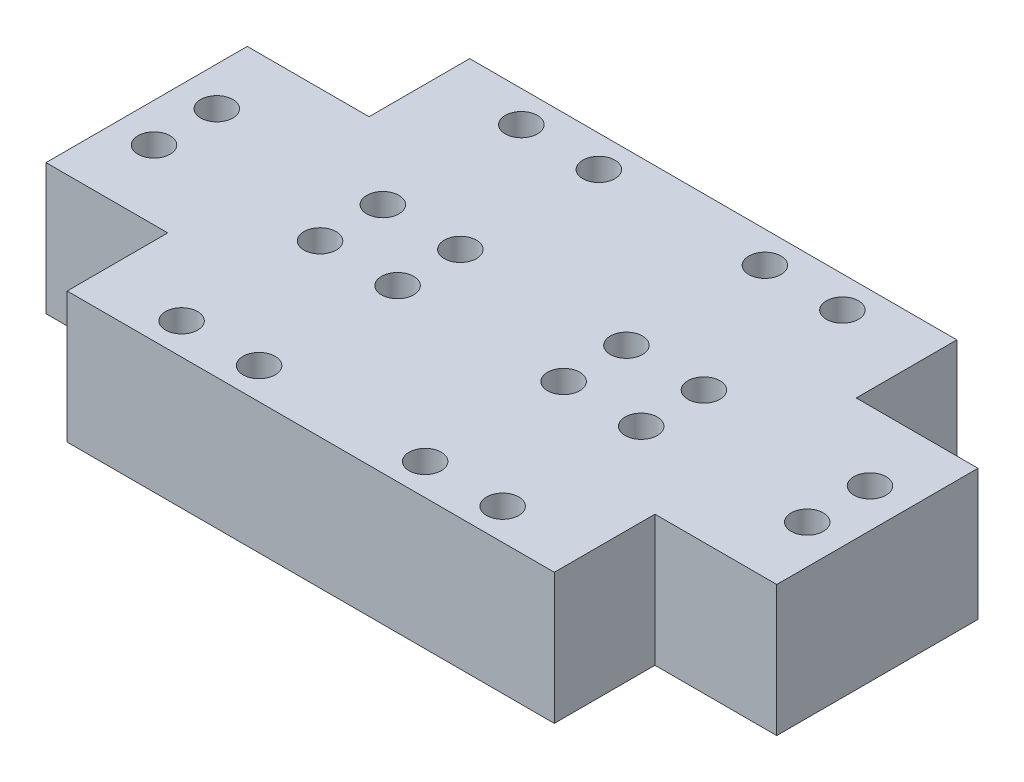
ISO-10303-21;
HEADER;
FILE_DESCRIPTION(('STEP AP214'),'2;1');
FILE_NAME('part.step','',(''),(''),'','','');
FILE_SCHEMA(('AUTOMOTIVE_DESIGN { 1 0 10303 214 1 1 1 1 }'));
ENDSEC;
DATA;
#1=APPLICATION_CONTEXT('core data for automotive mechanical design processes');
#2=APPLICATION_PROTOCOL_DEFINITION('international standard','automotive_design',2000,#1);
#3=PRODUCT_CONTEXT('',#1,'mechanical');
#4=PRODUCT('Part','Part','',(#3));
#5=PRODUCT_RELATED_PRODUCT_CATEGORY('part','',(#4));
#6=PRODUCT_DEFINITION_FORMATION('','',#4);
#7=PRODUCT_DEFINITION_CONTEXT('part definition',#1,'design');
#8=PRODUCT_DEFINITION('design','',#6,#7);
#9=PRODUCT_DEFINITION_SHAPE('','',#8);
#10=(LENGTH_UNIT() NAMED_UNIT(*) SI_UNIT(.MILLI.,.METRE.));
#11=(NAMED_UNIT(*) PLANE_ANGLE_UNIT() SI_UNIT($,.RADIAN.));
#12=(NAMED_UNIT(*) SI_UNIT($,.STERADIAN.) SOLID_ANGLE_UNIT());
#13=UNCERTAINTY_MEASURE_WITH_UNIT(LENGTH_MEASURE(1.E-05),#10,'distance_accuracy_value','');
#14=(GEOMETRIC_REPRESENTATION_CONTEXT(3) GLOBAL_UNCERTAINTY_ASSIGNED_CONTEXT((#13)) GLOBAL_UNIT_ASSIGNED_CONTEXT((#10,
#11,#12)) REPRESENTATION_CONTEXT('',''));
#15=CARTESIAN_POINT('',(0.,0.,0.));
#16=DIRECTION('',(0.,0.,1.));
#17=DIRECTION('',(1.,0.,0.));
#18=AXIS2_PLACEMENT_3D('',#15,#16,#17);
#19=CARTESIAN_POINT('',(0.,10.,0.));
#20=DIRECTION('',(0.,0.,-1.));
#21=DIRECTION('',(-1.,0.,0.));
#22=AXIS2_PLACEMENT_3D('',#19,#20,#21);
#23=PLANE('',#22);
#24=DIRECTION('',(0.,-1.,0.));
#25=VECTOR('',#24,1.);
#26=CARTESIAN_POINT('',(0.,10.,0.));
#27=LINE('',#26,#25);
#28=CARTESIAN_POINT('',(0.,10.,0.));
#29=VERTEX_POINT('',#28);
#30=CARTESIAN_POINT('',(0.,0.,0.));
#31=VERTEX_POINT('',#30);
#32=EDGE_CURVE('E53',#29,#31,#27,.T.);
#33=ORIENTED_EDGE('',*,*,#32,.F.);
#34=DIRECTION('',(1.,0.,0.));
#35=VECTOR('',#34,1.);
#36=CARTESIAN_POINT('',(0.,10.,0.));
#37=LINE('',#36,#35);
#38=CARTESIAN_POINT('',(-9.30453899683921,10.,0.));
#39=VERTEX_POINT('',#38);
#40=EDGE_CURVE('E11',#39,#29,#37,.T.);
#41=ORIENTED_EDGE('',*,*,#40,.F.);
#42=DIRECTION('',(0.,-1.,0.));
#43=VECTOR('',#42,1.);
#44=CARTESIAN_POINT('',(-9.30453899683921,10.,0.));
#45=LINE('',#44,#43);
#46=CARTESIAN_POINT('',(-9.30453899683921,0.,0.));
#47=VERTEX_POINT('',#46);
#48=EDGE_CURVE('E392',#39,#47,#45,.T.);
#49=ORIENTED_EDGE('',*,*,#48,.T.);
#50=DIRECTION('',(1.,0.,0.));
#51=VECTOR('',#50,1.);
#52=CARTESIAN_POINT('',(0.,0.,0.));
#53=LINE('',#52,#51);
#54=EDGE_CURVE('E41',#47,#31,#53,.T.);
#55=ORIENTED_EDGE('',*,*,#54,.T.);
#56=EDGE_LOOP('',(#33,#41,#49,#55));
#57=FACE_BOUND('',#56,.T.);
#58=ADVANCED_FACE('F38',(#57),#23,.F.);
#59=CARTESIAN_POINT('',(0.,10.,0.));
#60=DIRECTION('',(0.,-1.,0.));
#61=DIRECTION('',(0.,0.,-1.));
#62=AXIS2_PLACEMENT_3D('',#59,#60,#61);
#63=PLANE('',#62);
#64=DIRECTION('',(-1.,0.,0.));
#65=VECTOR('',#64,1.);
#66=CARTESIAN_POINT('',(0.,10.,7.68791394751453));
#67=LINE('',#66,#65);
#68=CARTESIAN_POINT('',(37.2181559873568,10.,7.68791394751453));
#69=VERTEX_POINT('',#68);
#70=CARTESIAN_POINT('',(0.,10.,7.68791394751453));
#71=VERTEX_POINT('',#70);
#72=EDGE_CURVE('E364',#69,#71,#67,.T.);
#73=ORIENTED_EDGE('',*,*,#72,.F.);
#74=DIRECTION('',(0.,0.,-1.));
#75=VECTOR('',#74,1.);
#76=CARTESIAN_POINT('',(37.2181559873568,10.,0.));
#77=LINE('',#76,#75);
#78=CARTESIAN_POINT('',(37.2181559873568,10.,0.));
#79=VERTEX_POINT('',#78);
#80=EDGE_CURVE('E222',#69,#79,#77,.T.);
#81=ORIENTED_EDGE('',*,*,#80,.T.);
#82=DIRECTION('',(-1.,0.,0.));
#83=VECTOR('',#82,1.);
#84=CARTESIAN_POINT('',(37.2181559873568,10.,0.));
#85=LINE('',#84,#83);
#86=CARTESIAN_POINT('',(46.5226949841961,10.,0.));
#87=VERTEX_POINT('',#86);
#88=EDGE_CURVE('E263',#87,#79,#85,.T.);
#89=ORIENTED_EDGE('',*,*,#88,.F.);
#90=DIRECTION('',(0.,0.,-1.));
#91=VECTOR('',#90,1.);
#92=CARTESIAN_POINT('',(46.5226949841961,10.,0.));
#93=LINE('',#92,#91);
#94=CARTESIAN_POINT('',(46.5226949841961,10.,-15.3758278950291));
#95=VERTEX_POINT('',#94);
#96=EDGE_CURVE('E244',#87,#95,#93,.T.);
#97=ORIENTED_EDGE('',*,*,#96,.T.);
#98=DIRECTION('',(-1.,0.,0.));
#99=VECTOR('',#98,1.);
#100=CARTESIAN_POINT('',(37.2181559873568,10.,-15.3758278950291));
#101=LINE('',#100,#99);
#102=CARTESIAN_POINT('',(37.2181559873568,10.,-15.3758278950291));
#103=VERTEX_POINT('',#102);
#104=EDGE_CURVE('E153',#95,#103,#101,.T.);
#105=ORIENTED_EDGE('',*,*,#104,.T.);
#106=DIRECTION('',(0.,0.,1.));
#107=VECTOR('',#106,1.);
#108=CARTESIAN_POINT('',(37.2181559873568,10.,-15.3758278950291));
#109=LINE('',#108,#107);
#110=CARTESIAN_POINT('',(37.2181559873568,10.,-23.0637418425436));
#111=VERTEX_POINT('',#110);
#112=EDGE_CURVE('E141',#111,#103,#109,.T.);
#113=ORIENTED_EDGE('',*,*,#112,.F.);
#114=DIRECTION('',(-1.,0.,0.));
#115=VECTOR('',#114,1.);
#116=CARTESIAN_POINT('',(0.,10.,-23.0637418425436));
#117=LINE('',#116,#115);
#118=CARTESIAN_POINT('',(0.,10.,-23.0637418425436));
#119=VERTEX_POINT('',#118);
#120=EDGE_CURVE('E124',#111,#119,#117,.T.);
#121=ORIENTED_EDGE('',*,*,#120,.T.);
#122=DIRECTION('',(0.,0.,1.));
#123=VECTOR('',#122,1.);
#124=CARTESIAN_POINT('',(0.,10.,-15.3758278950291));
#125=LINE('',#124,#123);
#126=CARTESIAN_POINT('',(0.,10.,-15.3758278950291));
#127=VERTEX_POINT('',#126);
#128=EDGE_CURVE('E136',#119,#127,#125,.T.);
#129=ORIENTED_EDGE('',*,*,#128,.T.);
#130=DIRECTION('',(1.,0.,0.));
#131=VECTOR('',#130,1.);
#132=CARTESIAN_POINT('',(0.,10.,-15.3758278950291));
#133=LINE('',#132,#131);
#134=CARTESIAN_POINT('',(-9.30453899683921,10.,-15.3758278950291));
#135=VERTEX_POINT('',#134);
#136=EDGE_CURVE('E312',#135,#127,#133,.T.);
#137=ORIENTED_EDGE('',*,*,#136,.F.);
#138=DIRECTION('',(0.,0.,-1.));
#139=VECTOR('',#138,1.);
#140=CARTESIAN_POINT('',(-9.30453899683921,10.,0.));
#141=LINE('',#140,#139);
#142=EDGE_CURVE('E389',#39,#135,#141,.T.);
#143=ORIENTED_EDGE('',*,*,#142,.F.);
#144=ORIENTED_EDGE('',*,*,#40,.T.);
#145=DIRECTION('',(0.,0.,-1.));
#146=VECTOR('',#145,1.);
#147=CARTESIAN_POINT('',(0.,10.,0.));
#148=LINE('',#147,#146);
#149=EDGE_CURVE('E360',#71,#29,#148,.T.);
#150=ORIENTED_EDGE('',*,*,#149,.F.);
#151=EDGE_LOOP('',(#73,#81,#89,#97,#105,#113,#121,#129,#137,#143,#144,#150));
#152=FACE_BOUND('',#151,.T.);
#153=CARTESIAN_POINT('',(6.34296608908176,10.,5.29045016504422));
#154=DIRECTION('',(0.,-1.,0.));
#155=DIRECTION('',(0.,0.,-1.));
#156=AXIS2_PLACEMENT_3D('',#153,#154,#155);
#157=CIRCLE('',#156,1.22977083134058);
#158=CARTESIAN_POINT('',(6.34296608908176,10.,4.06067933370364));
#159=VERTEX_POINT('',#158);
#160=EDGE_CURVE('E352',#159,#159,#157,.T.);
#161=ORIENTED_EDGE('',*,*,#160,.T.);
#162=EDGE_LOOP('',(#161));
#163=FACE_BOUND('',#162,.T.);
#164=CARTESIAN_POINT('',(12.2661119045967,10.,5.29045016504422));
#165=DIRECTION('',(0.,1.,0.));
#166=DIRECTION('',(0.,0.,-1.));
#167=AXIS2_PLACEMENT_3D('',#164,#165,#166);
#168=CIRCLE('',#167,1.22977083134058);
#169=CARTESIAN_POINT('',(12.2661119045967,10.,4.06067933370364));
#170=VERTEX_POINT('',#169);
#171=EDGE_CURVE('E328',#170,#170,#168,.T.);
#172=ORIENTED_EDGE('',*,*,#171,.F.);
#173=EDGE_LOOP('',(#172));
#174=FACE_BOUND('',#173,.T.);
#175=CARTESIAN_POINT('',(-6.34296608908176,10.,-5.29045016504422));
#176=DIRECTION('',(0.,-1.,0.));
#177=DIRECTION('',(0.,0.,1.));
#178=AXIS2_PLACEMENT_3D('',#175,#176,#177);
#179=CIRCLE('',#178,1.22977083134058);
#180=CARTESIAN_POINT('',(-6.34296608908176,10.,-4.06067933370364));
#181=VERTEX_POINT('',#180);
#182=EDGE_CURVE('E381',#181,#181,#179,.T.);
#183=ORIENTED_EDGE('',*,*,#182,.T.);
#184=EDGE_LOOP('',(#183));
#185=FACE_BOUND('',#184,.T.);
#186=CARTESIAN_POINT('',(6.34296608908176,10.,-5.29045016504422));
#187=DIRECTION('',(0.,1.,0.));
#188=DIRECTION('',(0.,0.,1.));
#189=AXIS2_PLACEMENT_3D('',#186,#187,#188);
#190=CIRCLE('',#189,1.22977083134058);
#191=CARTESIAN_POINT('',(6.34296608908176,10.,-4.06067933370364));
#192=VERTEX_POINT('',#191);
#193=EDGE_CURVE('E398',#192,#192,#190,.T.);
#194=ORIENTED_EDGE('',*,*,#193,.F.);
#195=EDGE_LOOP('',(#194));
#196=FACE_BOUND('',#195,.T.);
#197=CARTESIAN_POINT('',(6.34296608908176,10.,-10.0853777299848));
#198=DIRECTION('',(0.,-1.,0.));
#199=DIRECTION('',(0.,0.,-1.));
#200=AXIS2_PLACEMENT_3D('',#197,#198,#199);
#201=CIRCLE('',#200,1.22977083134058);
#202=CARTESIAN_POINT('',(6.34296608908176,10.,-11.3151485613254));
#203=VERTEX_POINT('',#202);
#204=EDGE_CURVE('E344',#203,#203,#201,.T.);
#205=ORIENTED_EDGE('',*,*,#204,.T.);
#206=EDGE_LOOP('',(#205));
#207=FACE_BOUND('',#206,.T.);
#208=CARTESIAN_POINT('',(12.2661119045967,10.,-10.0853777299848));
#209=DIRECTION('',(0.,1.,0.));
#210=DIRECTION('',(0.,0.,-1.));
#211=AXIS2_PLACEMENT_3D('',#208,#209,#210);
#212=CIRCLE('',#211,1.22977083134058);
#213=CARTESIAN_POINT('',(12.2661119045967,10.,-11.3151485613254));
#214=VERTEX_POINT('',#213);
#215=EDGE_CURVE('E336',#214,#214,#212,.T.);
#216=ORIENTED_EDGE('',*,*,#215,.F.);
#217=EDGE_LOOP('',(#216));
#218=FACE_BOUND('',#217,.T.);
#219=CARTESIAN_POINT('',(12.2661119045967,10.,-5.29045016504422));
#220=DIRECTION('',(0.,-1.,0.));
#221=DIRECTION('',(0.,0.,1.));
#222=AXIS2_PLACEMENT_3D('',#219,#220,#221);
#223=CIRCLE('',#222,1.22977083134058);
#224=CARTESIAN_POINT('',(12.2661119045967,10.,-4.06067933370364));
#225=VERTEX_POINT('',#224);
#226=EDGE_CURVE('E320',#225,#225,#223,.T.);
#227=ORIENTED_EDGE('',*,*,#226,.T.);
#228=EDGE_LOOP('',(#227));
#229=FACE_BOUND('',#228,.T.);
#230=CARTESIAN_POINT('',(6.34296608908176,10.,-20.6662780600733));
#231=DIRECTION('',(0.,1.,0.));
#232=DIRECTION('',(0.,0.,1.));
#233=AXIS2_PLACEMENT_3D('',#230,#231,#232);
#234=CIRCLE('',#233,1.22977083134058);
#235=CARTESIAN_POINT('',(6.34296608908176,10.,-19.4365072287327));
#236=VERTEX_POINT('',#235);
#237=EDGE_CURVE('E279',#236,#236,#234,.T.);
#238=ORIENTED_EDGE('',*,*,#237,.F.);
#239=EDGE_LOOP('',(#238));
#240=FACE_BOUND('',#239,.T.);
#241=CARTESIAN_POINT('',(12.2661119045967,10.,-20.6662780600733));
#242=DIRECTION('',(0.,-1.,0.));
#243=DIRECTION('',(0.,0.,1.));
#244=AXIS2_PLACEMENT_3D('',#241,#242,#243);
#245=CIRCLE('',#244,1.22977083134058);
#246=CARTESIAN_POINT('',(12.2661119045967,10.,-19.4365072287327));
#247=VERTEX_POINT('',#246);
#248=EDGE_CURVE('E271',#247,#247,#245,.T.);
#249=ORIENTED_EDGE('',*,*,#248,.T.);
#250=EDGE_LOOP('',(#249));
#251=FACE_BOUND('',#250,.T.);
#252=CARTESIAN_POINT('',(-6.34296608908176,10.,-10.0853777299848));
#253=DIRECTION('',(0.,1.,0.));
#254=DIRECTION('',(0.,0.,-1.));
#255=AXIS2_PLACEMENT_3D('',#252,#253,#254);
#256=CIRCLE('',#255,1.22977083134058);
#257=CARTESIAN_POINT('',(-6.34296608908176,10.,-11.3151485613254));
#258=VERTEX_POINT('',#257);
#259=EDGE_CURVE('E300',#258,#258,#256,.T.);
#260=ORIENTED_EDGE('',*,*,#259,.F.);
#261=EDGE_LOOP('',(#260));
#262=FACE_BOUND('',#261,.T.);
#263=CARTESIAN_POINT('',(30.8751898982751,10.,5.29045016504422));
#264=DIRECTION('',(0.,1.,0.));
#265=DIRECTION('',(0.,0.,-1.));
#266=AXIS2_PLACEMENT_3D('',#263,#264,#265);
#267=CIRCLE('',#266,1.22977083134058);
#268=CARTESIAN_POINT('',(30.8751898982751,10.,4.06067933370364));
#269=VERTEX_POINT('',#268);
#270=EDGE_CURVE('E214',#269,#269,#267,.T.);
#271=ORIENTED_EDGE('',*,*,#270,.F.);
#272=EDGE_LOOP('',(#271));
#273=FACE_BOUND('',#272,.T.);
#274=CARTESIAN_POINT('',(24.9520440827602,10.,5.29045016504422));
#275=DIRECTION('',(0.,-1.,0.));
#276=DIRECTION('',(0.,0.,-1.));
#277=AXIS2_PLACEMENT_3D('',#274,#275,#276);
#278=CIRCLE('',#277,1.22977083134058);
#279=CARTESIAN_POINT('',(24.9520440827602,10.,4.06067933370364));
#280=VERTEX_POINT('',#279);
#281=EDGE_CURVE('E190',#280,#280,#278,.T.);
#282=ORIENTED_EDGE('',*,*,#281,.T.);
#283=EDGE_LOOP('',(#282));
#284=FACE_BOUND('',#283,.T.);
#285=CARTESIAN_POINT('',(43.5611220764386,10.,-5.29045016504422));
#286=DIRECTION('',(0.,1.,0.));
#287=DIRECTION('',(0.,0.,1.));
#288=AXIS2_PLACEMENT_3D('',#285,#286,#287);
#289=CIRCLE('',#288,1.22977083134058);
#290=CARTESIAN_POINT('',(43.5611220764386,10.,-4.06067933370364));
#291=VERTEX_POINT('',#290);
#292=EDGE_CURVE('E236',#291,#291,#289,.T.);
#293=ORIENTED_EDGE('',*,*,#292,.F.);
#294=EDGE_LOOP('',(#293));
#295=FACE_BOUND('',#294,.T.);
#296=CARTESIAN_POINT('',(30.8751898982751,10.,-5.29045016504422));
#297=DIRECTION('',(0.,-1.,0.));
#298=DIRECTION('',(0.,0.,1.));
#299=AXIS2_PLACEMENT_3D('',#296,#297,#298);
#300=CIRCLE('',#299,1.22977083134058);
#301=CARTESIAN_POINT('',(30.8751898982751,10.,-4.06067933370364));
#302=VERTEX_POINT('',#301);
#303=EDGE_CURVE('E255',#302,#302,#300,.T.);
#304=ORIENTED_EDGE('',*,*,#303,.T.);
#305=EDGE_LOOP('',(#304));
#306=FACE_BOUND('',#305,.T.);
#307=CARTESIAN_POINT('',(30.8751898982751,10.,-10.0853777299848));
#308=DIRECTION('',(0.,1.,0.));
#309=DIRECTION('',(0.,0.,-1.));
#310=AXIS2_PLACEMENT_3D('',#307,#308,#309);
#311=CIRCLE('',#310,1.22977083134058);
#312=CARTESIAN_POINT('',(30.8751898982751,10.,-11.3151485613254));
#313=VERTEX_POINT('',#312);
#314=EDGE_CURVE('E206',#313,#313,#311,.T.);
#315=ORIENTED_EDGE('',*,*,#314,.F.);
#316=EDGE_LOOP('',(#315));
#317=FACE_BOUND('',#316,.T.);
#318=CARTESIAN_POINT('',(24.9520440827602,10.,-10.0853777299848));
#319=DIRECTION('',(0.,-1.,0.));
#320=DIRECTION('',(0.,0.,-1.));
#321=AXIS2_PLACEMENT_3D('',#318,#319,#320);
#322=CIRCLE('',#321,1.22977083134058);
#323=CARTESIAN_POINT('',(24.9520440827602,10.,-11.3151485613254));
#324=VERTEX_POINT('',#323);
#325=EDGE_CURVE('E198',#324,#324,#322,.T.);
#326=ORIENTED_EDGE('',*,*,#325,.T.);
#327=EDGE_LOOP('',(#326));
#328=FACE_BOUND('',#327,.T.);
#329=CARTESIAN_POINT('',(24.9520440827602,10.,-5.29045016504422));
#330=DIRECTION('',(0.,1.,0.));
#331=DIRECTION('',(0.,0.,1.));
#332=AXIS2_PLACEMENT_3D('',#329,#330,#331);
#333=CIRCLE('',#332,1.22977083134058);
#334=CARTESIAN_POINT('',(24.9520440827602,10.,-4.06067933370364));
#335=VERTEX_POINT('',#334);
#336=EDGE_CURVE('E182',#335,#335,#333,.T.);
#337=ORIENTED_EDGE('',*,*,#336,.F.);
#338=EDGE_LOOP('',(#337));
#339=FACE_BOUND('',#338,.T.);
#340=CARTESIAN_POINT('',(30.8751898982751,10.,-20.6662780600733));
#341=DIRECTION('',(0.,-1.,0.));
#342=DIRECTION('',(0.,0.,1.));
#343=AXIS2_PLACEMENT_3D('',#340,#341,#342);
#344=CIRCLE('',#343,1.22977083134058);
#345=CARTESIAN_POINT('',(30.8751898982751,10.,-19.4365072287327));
#346=VERTEX_POINT('',#345);
#347=EDGE_CURVE('E159',#346,#346,#344,.T.);
#348=ORIENTED_EDGE('',*,*,#347,.T.);
#349=EDGE_LOOP('',(#348));
#350=FACE_BOUND('',#349,.T.);
#351=CARTESIAN_POINT('',(24.9520440827602,10.,-20.6662780600733));
#352=DIRECTION('',(0.,1.,0.));
#353=DIRECTION('',(0.,0.,1.));
#354=AXIS2_PLACEMENT_3D('',#351,#352,#353);
#355=CIRCLE('',#354,1.22977083134058);
#356=CARTESIAN_POINT('',(24.9520440827602,10.,-19.4365072287327));
#357=VERTEX_POINT('',#356);
#358=EDGE_CURVE('E958',#357,#357,#355,.T.);
#359=ORIENTED_EDGE('',*,*,#358,.F.);
#360=EDGE_LOOP('',(#359));
#361=FACE_BOUND('',#360,.T.);
#362=CARTESIAN_POINT('',(43.5611220764386,10.,-10.0853777299848));
#363=DIRECTION('',(0.,-1.,0.));
#364=DIRECTION('',(0.,0.,-1.));
#365=AXIS2_PLACEMENT_3D('',#362,#363,#364);
#366=CIRCLE('',#365,1.22977083134058);
#367=CARTESIAN_POINT('',(43.5611220764386,10.,-11.3151485613254));
#368=VERTEX_POINT('',#367);
#369=EDGE_CURVE('E165',#368,#368,#366,.T.);
#370=ORIENTED_EDGE('',*,*,#369,.T.);
#371=EDGE_LOOP('',(#370));
#372=FACE_BOUND('',#371,.T.);
#373=ADVANCED_FACE('F149',(#152,#163,#174,#185,#196,#207,#218,#229,#240,#251,#262,#273,#284,
#295,#306,#317,#328,#339,#350,#361,#372),#63,.F.);
#374=CARTESIAN_POINT('',(0.,0.,0.));
#375=DIRECTION('',(0.,-1.,0.));
#376=DIRECTION('',(0.,0.,-1.));
#377=AXIS2_PLACEMENT_3D('',#374,#375,#376);
#378=PLANE('',#377);
#379=DIRECTION('',(0.,0.,-1.));
#380=VECTOR('',#379,1.);
#381=CARTESIAN_POINT('',(0.,0.,0.));
#382=LINE('',#381,#380);
#383=CARTESIAN_POINT('',(0.,0.,7.68791394751453));
#384=VERTEX_POINT('',#383);
#385=EDGE_CURVE('E356',#384,#31,#382,.T.);
#386=ORIENTED_EDGE('',*,*,#385,.T.);
#387=ORIENTED_EDGE('',*,*,#54,.F.);
#388=DIRECTION('',(0.,0.,-1.));
#389=VECTOR('',#388,1.);
#390=CARTESIAN_POINT('',(-9.30453899683921,0.,0.));
#391=LINE('',#390,#389);
#392=CARTESIAN_POINT('',(-9.30453899683921,0.,-15.3758278950291));
#393=VERTEX_POINT('',#392);
#394=EDGE_CURVE('E385',#47,#393,#391,.T.);
#395=ORIENTED_EDGE('',*,*,#394,.T.);
#396=DIRECTION('',(1.,0.,0.));
#397=VECTOR('',#396,1.);
#398=CARTESIAN_POINT('',(0.,0.,-15.3758278950291));
#399=LINE('',#398,#397);
#400=CARTESIAN_POINT('',(0.,0.,-15.3758278950291));
#401=VERTEX_POINT('',#400);
#402=EDGE_CURVE('E311',#393,#401,#399,.T.);
#403=ORIENTED_EDGE('',*,*,#402,.T.);
#404=DIRECTION('',(0.,0.,1.));
#405=VECTOR('',#404,1.);
#406=CARTESIAN_POINT('',(0.,0.,-15.3758278950291));
#407=LINE('',#406,#405);
#408=CARTESIAN_POINT('',(0.,0.,-23.0637418425436));
#409=VERTEX_POINT('',#408);
#410=EDGE_CURVE('E283',#409,#401,#407,.T.);
#411=ORIENTED_EDGE('',*,*,#410,.F.);
#412=DIRECTION('',(-1.,0.,0.));
#413=VECTOR('',#412,1.);
#414=CARTESIAN_POINT('',(0.,0.,-23.0637418425436));
#415=LINE('',#414,#413);
#416=CARTESIAN_POINT('',(37.2181559873568,0.,-23.0637418425436));
#417=VERTEX_POINT('',#416);
#418=EDGE_CURVE('E288',#417,#409,#415,.T.);
#419=ORIENTED_EDGE('',*,*,#418,.F.);
#420=DIRECTION('',(0.,0.,1.));
#421=VECTOR('',#420,1.);
#422=CARTESIAN_POINT('',(37.2181559873568,0.,-15.3758278950291));
#423=LINE('',#422,#421);
#424=CARTESIAN_POINT('',(37.2181559873568,0.,-15.3758278950291));
#425=VERTEX_POINT('',#424);
#426=EDGE_CURVE('E144',#417,#425,#423,.T.);
#427=ORIENTED_EDGE('',*,*,#426,.T.);
#428=DIRECTION('',(-1.,0.,0.));
#429=VECTOR('',#428,1.);
#430=CARTESIAN_POINT('',(37.2181559873568,0.,-15.3758278950291));
#431=LINE('',#430,#429);
#432=CARTESIAN_POINT('',(46.5226949841961,0.,-15.3758278950291));
#433=VERTEX_POINT('',#432);
#434=EDGE_CURVE('E175',#433,#425,#431,.T.);
#435=ORIENTED_EDGE('',*,*,#434,.F.);
#436=DIRECTION('',(0.,0.,-1.));
#437=VECTOR('',#436,1.);
#438=CARTESIAN_POINT('',(46.5226949841961,0.,0.));
#439=LINE('',#438,#437);
#440=CARTESIAN_POINT('',(46.5226949841961,0.,0.));
#441=VERTEX_POINT('',#440);
#442=EDGE_CURVE('E240',#441,#433,#439,.T.);
#443=ORIENTED_EDGE('',*,*,#442,.F.);
#444=DIRECTION('',(-1.,0.,0.));
#445=VECTOR('',#444,1.);
#446=CARTESIAN_POINT('',(37.2181559873568,0.,0.));
#447=LINE('',#446,#445);
#448=CARTESIAN_POINT('',(37.2181559873568,0.,0.));
#449=VERTEX_POINT('',#448);
#450=EDGE_CURVE('E259',#441,#449,#447,.T.);
#451=ORIENTED_EDGE('',*,*,#450,.T.);
#452=DIRECTION('',(0.,0.,-1.));
#453=VECTOR('',#452,1.);
#454=CARTESIAN_POINT('',(37.2181559873568,0.,0.));
#455=LINE('',#454,#453);
#456=CARTESIAN_POINT('',(37.2181559873568,0.,7.68791394751453));
#457=VERTEX_POINT('',#456);
#458=EDGE_CURVE('E218',#457,#449,#455,.T.);
#459=ORIENTED_EDGE('',*,*,#458,.F.);
#460=DIRECTION('',(-1.,0.,0.));
#461=VECTOR('',#460,1.);
#462=CARTESIAN_POINT('',(0.,0.,7.68791394751453));
#463=LINE('',#462,#461);
#464=EDGE_CURVE('E365',#457,#384,#463,.T.);
#465=ORIENTED_EDGE('',*,*,#464,.T.);
#466=EDGE_LOOP('',(#386,#387,#395,#403,#411,#419,#427,#435,#443,#451,#459,#465));
#467=FACE_BOUND('',#466,.T.);
#468=CARTESIAN_POINT('',(6.34296608908176,0.,5.29045016504422));
#469=DIRECTION('',(0.,-1.,0.));
#470=DIRECTION('',(0.,0.,-1.));
#471=AXIS2_PLACEMENT_3D('',#468,#469,#470);
#472=CIRCLE('',#471,1.22977083134058);
#473=CARTESIAN_POINT('',(6.34296608908176,0.,4.06067933370364));
#474=VERTEX_POINT('',#473);
#475=EDGE_CURVE('E348',#474,#474,#472,.T.);
#476=ORIENTED_EDGE('',*,*,#475,.F.);
#477=EDGE_LOOP('',(#476));
#478=FACE_BOUND('',#477,.T.);
#479=CARTESIAN_POINT('',(12.2661119045967,0.,5.29045016504422));
#480=DIRECTION('',(0.,1.,0.));
#481=DIRECTION('',(0.,0.,-1.));
#482=AXIS2_PLACEMENT_3D('',#479,#480,#481);
#483=CIRCLE('',#482,1.22977083134058);
#484=CARTESIAN_POINT('',(12.2661119045967,0.,4.06067933370364));
#485=VERTEX_POINT('',#484);
#486=EDGE_CURVE('E324',#485,#485,#483,.T.);
#487=ORIENTED_EDGE('',*,*,#486,.T.);
#488=EDGE_LOOP('',(#487));
#489=FACE_BOUND('',#488,.T.);
#490=CARTESIAN_POINT('',(-6.34296608908176,0.,-5.29045016504422));
#491=DIRECTION('',(0.,-1.,0.));
#492=DIRECTION('',(0.,0.,1.));
#493=AXIS2_PLACEMENT_3D('',#490,#491,#492);
#494=CIRCLE('',#493,1.22977083134058);
#495=CARTESIAN_POINT('',(-6.34296608908176,0.,-4.06067933370364));
#496=VERTEX_POINT('',#495);
#497=EDGE_CURVE('E380',#496,#496,#494,.T.);
#498=ORIENTED_EDGE('',*,*,#497,.F.);
#499=EDGE_LOOP('',(#498));
#500=FACE_BOUND('',#499,.T.);
#501=CARTESIAN_POINT('',(6.34296608908176,0.,-5.29045016504422));
#502=DIRECTION('',(0.,1.,0.));
#503=DIRECTION('',(0.,0.,1.));
#504=AXIS2_PLACEMENT_3D('',#501,#502,#503);
#505=CIRCLE('',#504,1.22977083134058);
#506=CARTESIAN_POINT('',(6.34296608908176,0.,-4.06067933370364));
#507=VERTEX_POINT('',#506);
#508=EDGE_CURVE('E397',#507,#507,#505,.T.);
#509=ORIENTED_EDGE('',*,*,#508,.T.);
#510=EDGE_LOOP('',(#509));
#511=FACE_BOUND('',#510,.T.);
#512=CARTESIAN_POINT('',(6.34296608908176,0.,-10.0853777299848));
#513=DIRECTION('',(0.,-1.,0.));
#514=DIRECTION('',(0.,0.,-1.));
#515=AXIS2_PLACEMENT_3D('',#512,#513,#514);
#516=CIRCLE('',#515,1.22977083134058);
#517=CARTESIAN_POINT('',(6.34296608908176,0.,-11.3151485613254));
#518=VERTEX_POINT('',#517);
#519=EDGE_CURVE('E340',#518,#518,#516,.T.);
#520=ORIENTED_EDGE('',*,*,#519,.F.);
#521=EDGE_LOOP('',(#520));
#522=FACE_BOUND('',#521,.T.);
#523=CARTESIAN_POINT('',(12.2661119045967,0.,-10.0853777299848));
#524=DIRECTION('',(0.,1.,0.));
#525=DIRECTION('',(0.,0.,-1.));
#526=AXIS2_PLACEMENT_3D('',#523,#524,#525);
#527=CIRCLE('',#526,1.22977083134058);
#528=CARTESIAN_POINT('',(12.2661119045967,0.,-11.3151485613254));
#529=VERTEX_POINT('',#528);
#530=EDGE_CURVE('E332',#529,#529,#527,.T.);
#531=ORIENTED_EDGE('',*,*,#530,.T.);
#532=EDGE_LOOP('',(#531));
#533=FACE_BOUND('',#532,.T.);
#534=CARTESIAN_POINT('',(12.2661119045967,0.,-5.29045016504422));
#535=DIRECTION('',(0.,-1.,0.));
#536=DIRECTION('',(0.,0.,1.));
#537=AXIS2_PLACEMENT_3D('',#534,#535,#536);
#538=CIRCLE('',#537,1.22977083134058);
#539=CARTESIAN_POINT('',(12.2661119045967,0.,-4.06067933370364));
#540=VERTEX_POINT('',#539);
#541=EDGE_CURVE('E316',#540,#540,#538,.T.);
#542=ORIENTED_EDGE('',*,*,#541,.F.);
#543=EDGE_LOOP('',(#542));
#544=FACE_BOUND('',#543,.T.);
#545=CARTESIAN_POINT('',(6.34296608908176,0.,-20.6662780600733));
#546=DIRECTION('',(0.,1.,0.));
#547=DIRECTION('',(0.,0.,1.));
#548=AXIS2_PLACEMENT_3D('',#545,#546,#547);
#549=CIRCLE('',#548,1.22977083134058);
#550=CARTESIAN_POINT('',(6.34296608908176,0.,-19.4365072287327));
#551=VERTEX_POINT('',#550);
#552=EDGE_CURVE('E275',#551,#551,#549,.T.);
#553=ORIENTED_EDGE('',*,*,#552,.T.);
#554=EDGE_LOOP('',(#553));
#555=FACE_BOUND('',#554,.T.);
#556=CARTESIAN_POINT('',(12.2661119045967,0.,-20.6662780600733));
#557=DIRECTION('',(0.,-1.,0.));
#558=DIRECTION('',(0.,0.,1.));
#559=AXIS2_PLACEMENT_3D('',#556,#557,#558);
#560=CIRCLE('',#559,1.22977083134058);
#561=CARTESIAN_POINT('',(12.2661119045967,0.,-19.4365072287327));
#562=VERTEX_POINT('',#561);
#563=EDGE_CURVE('E267',#562,#562,#560,.T.);
#564=ORIENTED_EDGE('',*,*,#563,.F.);
#565=EDGE_LOOP('',(#564));
#566=FACE_BOUND('',#565,.T.);
#567=CARTESIAN_POINT('',(-6.34296608908176,0.,-10.0853777299848));
#568=DIRECTION('',(0.,1.,0.));
#569=DIRECTION('',(0.,0.,-1.));
#570=AXIS2_PLACEMENT_3D('',#567,#568,#569);
#571=CIRCLE('',#570,1.22977083134058);
#572=CARTESIAN_POINT('',(-6.34296608908176,0.,-11.3151485613254));
#573=VERTEX_POINT('',#572);
#574=EDGE_CURVE('E299',#573,#573,#571,.T.);
#575=ORIENTED_EDGE('',*,*,#574,.T.);
#576=EDGE_LOOP('',(#575));
#577=FACE_BOUND('',#576,.T.);
#578=CARTESIAN_POINT('',(30.8751898982751,0.,5.29045016504422));
#579=DIRECTION('',(0.,1.,0.));
#580=DIRECTION('',(0.,0.,-1.));
#581=AXIS2_PLACEMENT_3D('',#578,#579,#580);
#582=CIRCLE('',#581,1.22977083134058);
#583=CARTESIAN_POINT('',(30.8751898982751,0.,4.06067933370364));
#584=VERTEX_POINT('',#583);
#585=EDGE_CURVE('E210',#584,#584,#582,.T.);
#586=ORIENTED_EDGE('',*,*,#585,.T.);
#587=EDGE_LOOP('',(#586));
#588=FACE_BOUND('',#587,.T.);
#589=CARTESIAN_POINT('',(24.9520440827602,0.,5.29045016504422));
#590=DIRECTION('',(0.,-1.,0.));
#591=DIRECTION('',(0.,0.,-1.));
#592=AXIS2_PLACEMENT_3D('',#589,#590,#591);
#593=CIRCLE('',#592,1.22977083134058);
#594=CARTESIAN_POINT('',(24.9520440827602,0.,4.06067933370364));
#595=VERTEX_POINT('',#594);
#596=EDGE_CURVE('E186',#595,#595,#593,.T.);
#597=ORIENTED_EDGE('',*,*,#596,.F.);
#598=EDGE_LOOP('',(#597));
#599=FACE_BOUND('',#598,.T.);
#600=CARTESIAN_POINT('',(43.5611220764386,0.,-5.29045016504422));
#601=DIRECTION('',(0.,1.,0.));
#602=DIRECTION('',(0.,0.,1.));
#603=AXIS2_PLACEMENT_3D('',#600,#601,#602);
#604=CIRCLE('',#603,1.22977083134058);
#605=CARTESIAN_POINT('',(43.5611220764386,0.,-4.06067933370364));
#606=VERTEX_POINT('',#605);
#607=EDGE_CURVE('E235',#606,#606,#604,.T.);
#608=ORIENTED_EDGE('',*,*,#607,.T.);
#609=EDGE_LOOP('',(#608));
#610=FACE_BOUND('',#609,.T.);
#611=CARTESIAN_POINT('',(30.8751898982751,0.,-5.29045016504422));
#612=DIRECTION('',(0.,-1.,0.));
#613=DIRECTION('',(0.,0.,1.));
#614=AXIS2_PLACEMENT_3D('',#611,#612,#613);
#615=CIRCLE('',#614,1.22977083134058);
#616=CARTESIAN_POINT('',(30.8751898982751,0.,-4.06067933370364));
#617=VERTEX_POINT('',#616);
#618=EDGE_CURVE('E254',#617,#617,#615,.T.);
#619=ORIENTED_EDGE('',*,*,#618,.F.);
#620=EDGE_LOOP('',(#619));
#621=FACE_BOUND('',#620,.T.);
#622=CARTESIAN_POINT('',(30.8751898982751,0.,-10.0853777299848));
#623=DIRECTION('',(0.,1.,0.));
#624=DIRECTION('',(0.,0.,-1.));
#625=AXIS2_PLACEMENT_3D('',#622,#623,#624);
#626=CIRCLE('',#625,1.22977083134058);
#627=CARTESIAN_POINT('',(30.8751898982751,0.,-11.3151485613254));
#628=VERTEX_POINT('',#627);
#629=EDGE_CURVE('E202',#628,#628,#626,.T.);
#630=ORIENTED_EDGE('',*,*,#629,.T.);
#631=EDGE_LOOP('',(#630));
#632=FACE_BOUND('',#631,.T.);
#633=CARTESIAN_POINT('',(24.9520440827602,0.,-10.0853777299848));
#634=DIRECTION('',(0.,-1.,0.));
#635=DIRECTION('',(0.,0.,-1.));
#636=AXIS2_PLACEMENT_3D('',#633,#634,#635);
#637=CIRCLE('',#636,1.22977083134058);
#638=CARTESIAN_POINT('',(24.9520440827602,0.,-11.3151485613254));
#639=VERTEX_POINT('',#638);
#640=EDGE_CURVE('E194',#639,#639,#637,.T.);
#641=ORIENTED_EDGE('',*,*,#640,.F.);
#642=EDGE_LOOP('',(#641));
#643=FACE_BOUND('',#642,.T.);
#644=CARTESIAN_POINT('',(24.9520440827602,0.,-5.29045016504422));
#645=DIRECTION('',(0.,1.,0.));
#646=DIRECTION('',(0.,0.,1.));
#647=AXIS2_PLACEMENT_3D('',#644,#645,#646);
#648=CIRCLE('',#647,1.22977083134058);
#649=CARTESIAN_POINT('',(24.9520440827602,0.,-4.06067933370364));
#650=VERTEX_POINT('',#649);
#651=EDGE_CURVE('E178',#650,#650,#648,.T.);
#652=ORIENTED_EDGE('',*,*,#651,.T.);
#653=EDGE_LOOP('',(#652));
#654=FACE_BOUND('',#653,.T.);
#655=CARTESIAN_POINT('',(30.8751898982751,0.,-20.6662780600733));
#656=DIRECTION('',(0.,-1.,0.));
#657=DIRECTION('',(0.,0.,1.));
#658=AXIS2_PLACEMENT_3D('',#655,#656,#657);
#659=CIRCLE('',#658,1.22977083134058);
#660=CARTESIAN_POINT('',(30.8751898982751,0.,-19.4365072287327));
#661=VERTEX_POINT('',#660);
#662=EDGE_CURVE('E162',#661,#661,#659,.T.);
#663=ORIENTED_EDGE('',*,*,#662,.F.);
#664=EDGE_LOOP('',(#663));
#665=FACE_BOUND('',#664,.T.);
#666=CARTESIAN_POINT('',(24.9520440827602,0.,-20.6662780600733));
#667=DIRECTION('',(0.,1.,0.));
#668=DIRECTION('',(0.,0.,1.));
#669=AXIS2_PLACEMENT_3D('',#666,#667,#668);
#670=CIRCLE('',#669,1.22977083134058);
#671=CARTESIAN_POINT('',(24.9520440827602,0.,-19.4365072287327));
#672=VERTEX_POINT('',#671);
#673=EDGE_CURVE('E964',#672,#672,#670,.T.);
#674=ORIENTED_EDGE('',*,*,#673,.T.);
#675=EDGE_LOOP('',(#674));
#676=FACE_BOUND('',#675,.T.);
#677=CARTESIAN_POINT('',(43.5611220764386,0.,-10.0853777299848));
#678=DIRECTION('',(0.,-1.,0.));
#679=DIRECTION('',(0.,0.,-1.));
#680=AXIS2_PLACEMENT_3D('',#677,#678,#679);
#681=CIRCLE('',#680,1.22977083134058);
#682=CARTESIAN_POINT('',(43.5611220764386,0.,-11.3151485613254));
#683=VERTEX_POINT('',#682);
#684=EDGE_CURVE('E146',#683,#683,#681,.T.);
#685=ORIENTED_EDGE('',*,*,#684,.F.);
#686=EDGE_LOOP('',(#685));
#687=FACE_BOUND('',#686,.T.);
#688=ADVANCED_FACE('F406',(#467,#478,#489,#500,#511,#522,#533,#544,#555,#566,#577,#588,#599,
#610,#621,#632,#643,#654,#665,#676,#687),#378,.T.);
#689=CARTESIAN_POINT('',(6.34296608908176,10.,-5.29045016504422));
#690=DIRECTION('',(0.,-1.,0.));
#691=DIRECTION('',(0.,0.,-1.));
#692=AXIS2_PLACEMENT_3D('',#689,#690,#691);
#693=CYLINDRICAL_SURFACE('',#692,1.22977083134058);
#694=ORIENTED_EDGE('',*,*,#193,.T.);
#695=EDGE_LOOP('',(#694));
#696=FACE_BOUND('',#695,.T.);
#697=ORIENTED_EDGE('',*,*,#508,.F.);
#698=EDGE_LOOP('',(#697));
#699=FACE_BOUND('',#698,.T.);
#700=ADVANCED_FACE('F409',(#696,#699),#693,.F.);
#701=CARTESIAN_POINT('',(-9.30453899683921,10.,0.));
#702=DIRECTION('',(-1.,0.,0.));
#703=DIRECTION('',(0.,0.,1.));
#704=AXIS2_PLACEMENT_3D('',#701,#702,#703);
#705=PLANE('',#704);
#706=ORIENTED_EDGE('',*,*,#394,.F.);
#707=ORIENTED_EDGE('',*,*,#48,.F.);
#708=ORIENTED_EDGE('',*,*,#142,.T.);
#709=DIRECTION('',(0.,-1.,0.));
#710=VECTOR('',#709,1.);
#711=CARTESIAN_POINT('',(-9.30453899683921,10.,-15.3758278950291));
#712=LINE('',#711,#710);
#713=EDGE_CURVE('E304',#135,#393,#712,.T.);
#714=ORIENTED_EDGE('',*,*,#713,.T.);
#715=EDGE_LOOP('',(#706,#707,#708,#714));
#716=FACE_BOUND('',#715,.T.);
#717=ADVANCED_FACE('F411',(#716),#705,.T.);
#718=CARTESIAN_POINT('',(-6.34296608908176,10.,-5.29045016504422));
#719=DIRECTION('',(0.,-1.,0.));
#720=DIRECTION('',(0.,0.,-1.));
#721=AXIS2_PLACEMENT_3D('',#718,#719,#720);
#722=CYLINDRICAL_SURFACE('',#721,1.22977083134058);
#723=ORIENTED_EDGE('',*,*,#182,.F.);
#724=EDGE_LOOP('',(#723));
#725=FACE_BOUND('',#724,.T.);
#726=ORIENTED_EDGE('',*,*,#497,.T.);
#727=EDGE_LOOP('',(#726));
#728=FACE_BOUND('',#727,.T.);
#729=ADVANCED_FACE('F418',(#725,#728),#722,.F.);
#730=CARTESIAN_POINT('',(0.,10.,0.));
#731=DIRECTION('',(-1.,0.,0.));
#732=DIRECTION('',(0.,0.,1.));
#733=AXIS2_PLACEMENT_3D('',#730,#731,#732);
#734=PLANE('',#733);
#735=ORIENTED_EDGE('',*,*,#385,.F.);
#736=DIRECTION('',(0.,-1.,0.));
#737=VECTOR('',#736,1.);
#738=CARTESIAN_POINT('',(0.,10.,7.68791394751453));
#739=LINE('',#738,#737);
#740=EDGE_CURVE('E377',#71,#384,#739,.T.);
#741=ORIENTED_EDGE('',*,*,#740,.F.);
#742=ORIENTED_EDGE('',*,*,#149,.T.);
#743=ORIENTED_EDGE('',*,*,#32,.T.);
#744=EDGE_LOOP('',(#735,#741,#742,#743));
#745=FACE_BOUND('',#744,.T.);
#746=ADVANCED_FACE('F451',(#745),#734,.T.);
#747=CARTESIAN_POINT('',(0.,10.,7.68791394751453));
#748=DIRECTION('',(0.,0.,1.));
#749=DIRECTION('',(1.,0.,0.));
#750=AXIS2_PLACEMENT_3D('',#747,#748,#749);
#751=PLANE('',#750);
#752=ORIENTED_EDGE('',*,*,#464,.F.);
#753=DIRECTION('',(0.,-1.,0.));
#754=VECTOR('',#753,1.);
#755=CARTESIAN_POINT('',(37.2181559873568,10.,7.68791394751453));
#756=LINE('',#755,#754);
#757=EDGE_CURVE('E231',#69,#457,#756,.T.);
#758=ORIENTED_EDGE('',*,*,#757,.F.);
#759=ORIENTED_EDGE('',*,*,#72,.T.);
#760=ORIENTED_EDGE('',*,*,#740,.T.);
#761=EDGE_LOOP('',(#752,#758,#759,#760));
#762=FACE_BOUND('',#761,.T.);
#763=ADVANCED_FACE('F446',(#762),#751,.T.);
#764=CARTESIAN_POINT('',(6.34296608908176,10.,5.29045016504422));
#765=DIRECTION('',(0.,-1.,0.));
#766=DIRECTION('',(0.,0.,-1.));
#767=AXIS2_PLACEMENT_3D('',#764,#765,#766);
#768=CYLINDRICAL_SURFACE('',#767,1.22977083134058);
#769=ORIENTED_EDGE('',*,*,#160,.F.);
#770=EDGE_LOOP('',(#769));
#771=FACE_BOUND('',#770,.T.);
#772=ORIENTED_EDGE('',*,*,#475,.T.);
#773=EDGE_LOOP('',(#772));
#774=FACE_BOUND('',#773,.T.);
#775=ADVANCED_FACE('F450',(#771,#774),#768,.F.);
#776=CARTESIAN_POINT('',(6.34296608908176,10.,-10.0853777299848));
#777=DIRECTION('',(0.,-1.,0.));
#778=DIRECTION('',(0.,0.,-1.));
#779=AXIS2_PLACEMENT_3D('',#776,#777,#778);
#780=CYLINDRICAL_SURFACE('',#779,1.22977083134058);
#781=ORIENTED_EDGE('',*,*,#204,.F.);
#782=EDGE_LOOP('',(#781));
#783=FACE_BOUND('',#782,.T.);
#784=ORIENTED_EDGE('',*,*,#519,.T.);
#785=EDGE_LOOP('',(#784));
#786=FACE_BOUND('',#785,.T.);
#787=ADVANCED_FACE('F689',(#783,#786),#780,.F.);
#788=CARTESIAN_POINT('',(12.2661119045967,10.,-10.0853777299848));
#789=DIRECTION('',(0.,-1.,0.));
#790=DIRECTION('',(0.,0.,-1.));
#791=AXIS2_PLACEMENT_3D('',#788,#789,#790);
#792=CYLINDRICAL_SURFACE('',#791,1.22977083134058);
#793=ORIENTED_EDGE('',*,*,#215,.T.);
#794=EDGE_LOOP('',(#793));
#795=FACE_BOUND('',#794,.T.);
#796=ORIENTED_EDGE('',*,*,#530,.F.);
#797=EDGE_LOOP('',(#796));
#798=FACE_BOUND('',#797,.T.);
#799=ADVANCED_FACE('F680',(#795,#798),#792,.F.);
#800=CARTESIAN_POINT('',(12.2661119045967,10.,5.29045016504422));
#801=DIRECTION('',(0.,-1.,0.));
#802=DIRECTION('',(0.,0.,-1.));
#803=AXIS2_PLACEMENT_3D('',#800,#801,#802);
#804=CYLINDRICAL_SURFACE('',#803,1.22977083134058);
#805=ORIENTED_EDGE('',*,*,#171,.T.);
#806=EDGE_LOOP('',(#805));
#807=FACE_BOUND('',#806,.T.);
#808=ORIENTED_EDGE('',*,*,#486,.F.);
#809=EDGE_LOOP('',(#808));
#810=FACE_BOUND('',#809,.T.);
#811=ADVANCED_FACE('F671',(#807,#810),#804,.F.);
#812=CARTESIAN_POINT('',(12.2661119045967,10.,-5.29045016504422));
#813=DIRECTION('',(0.,-1.,0.));
#814=DIRECTION('',(0.,0.,-1.));
#815=AXIS2_PLACEMENT_3D('',#812,#813,#814);
#816=CYLINDRICAL_SURFACE('',#815,1.22977083134058);
#817=ORIENTED_EDGE('',*,*,#226,.F.);
#818=EDGE_LOOP('',(#817));
#819=FACE_BOUND('',#818,.T.);
#820=ORIENTED_EDGE('',*,*,#541,.T.);
#821=EDGE_LOOP('',(#820));
#822=FACE_BOUND('',#821,.T.);
#823=ADVANCED_FACE('F663',(#819,#822),#816,.F.);
#824=CARTESIAN_POINT('',(0.,10.,-15.3758278950291));
#825=DIRECTION('',(0.,0.,1.));
#826=DIRECTION('',(-1.,0.,0.));
#827=AXIS2_PLACEMENT_3D('',#824,#825,#826);
#828=PLANE('',#827);
#829=DIRECTION('',(0.,-1.,0.));
#830=VECTOR('',#829,1.);
#831=CARTESIAN_POINT('',(0.,10.,-15.3758278950291));
#832=LINE('',#831,#830);
#833=EDGE_CURVE('E135',#127,#401,#832,.T.);
#834=ORIENTED_EDGE('',*,*,#833,.T.);
#835=ORIENTED_EDGE('',*,*,#402,.F.);
#836=ORIENTED_EDGE('',*,*,#713,.F.);
#837=ORIENTED_EDGE('',*,*,#136,.T.);
#838=EDGE_LOOP('',(#834,#835,#836,#837));
#839=FACE_BOUND('',#838,.T.);
#840=ADVANCED_FACE('F656',(#839),#828,.F.);
#841=CARTESIAN_POINT('',(-6.34296608908176,10.,-10.0853777299848));
#842=DIRECTION('',(0.,-1.,0.));
#843=DIRECTION('',(0.,0.,1.));
#844=AXIS2_PLACEMENT_3D('',#841,#842,#843);
#845=CYLINDRICAL_SURFACE('',#844,1.22977083134058);
#846=ORIENTED_EDGE('',*,*,#259,.T.);
#847=EDGE_LOOP('',(#846));
#848=FACE_BOUND('',#847,.T.);
#849=ORIENTED_EDGE('',*,*,#574,.F.);
#850=EDGE_LOOP('',(#849));
#851=FACE_BOUND('',#850,.T.);
#852=ADVANCED_FACE('F648',(#848,#851),#845,.F.);
#853=CARTESIAN_POINT('',(0.,10.,-15.3758278950291));
#854=DIRECTION('',(-1.,0.,0.));
#855=DIRECTION('',(0.,0.,-1.));
#856=AXIS2_PLACEMENT_3D('',#853,#854,#855);
#857=PLANE('',#856);
#858=ORIENTED_EDGE('',*,*,#410,.T.);
#859=ORIENTED_EDGE('',*,*,#833,.F.);
#860=ORIENTED_EDGE('',*,*,#128,.F.);
#861=DIRECTION('',(0.,-1.,0.));
#862=VECTOR('',#861,1.);
#863=CARTESIAN_POINT('',(0.,10.,-23.0637418425436));
#864=LINE('',#863,#862);
#865=EDGE_CURVE('E130',#119,#409,#864,.T.);
#866=ORIENTED_EDGE('',*,*,#865,.T.);
#867=EDGE_LOOP('',(#858,#859,#860,#866));
#868=FACE_BOUND('',#867,.T.);
#869=ADVANCED_FACE('F461',(#868),#857,.T.);
#870=CARTESIAN_POINT('',(0.,10.,-23.0637418425436));
#871=DIRECTION('',(0.,0.,-1.));
#872=DIRECTION('',(1.,0.,0.));
#873=AXIS2_PLACEMENT_3D('',#870,#871,#872);
#874=PLANE('',#873);
#875=ORIENTED_EDGE('',*,*,#418,.T.);
#876=ORIENTED_EDGE('',*,*,#865,.F.);
#877=ORIENTED_EDGE('',*,*,#120,.F.);
#878=DIRECTION('',(0.,-1.,0.));
#879=VECTOR('',#878,1.);
#880=CARTESIAN_POINT('',(37.2181559873568,10.,-23.0637418425436));
#881=LINE('',#880,#879);
#882=EDGE_CURVE('E128',#111,#417,#881,.T.);
#883=ORIENTED_EDGE('',*,*,#882,.T.);
#884=EDGE_LOOP('',(#875,#876,#877,#883));
#885=FACE_BOUND('',#884,.T.);
#886=ADVANCED_FACE('F127',(#885),#874,.T.);
#887=CARTESIAN_POINT('',(6.34296608908176,10.,-20.6662780600733));
#888=DIRECTION('',(0.,-1.,0.));
#889=DIRECTION('',(0.,0.,1.));
#890=AXIS2_PLACEMENT_3D('',#887,#888,#889);
#891=CYLINDRICAL_SURFACE('',#890,1.22977083134058);
#892=ORIENTED_EDGE('',*,*,#237,.T.);
#893=EDGE_LOOP('',(#892));
#894=FACE_BOUND('',#893,.T.);
#895=ORIENTED_EDGE('',*,*,#552,.F.);
#896=EDGE_LOOP('',(#895));
#897=FACE_BOUND('',#896,.T.);
#898=ADVANCED_FACE('F460',(#894,#897),#891,.F.);
#899=CARTESIAN_POINT('',(12.2661119045967,10.,-20.6662780600733));
#900=DIRECTION('',(0.,-1.,0.));
#901=DIRECTION('',(0.,0.,1.));
#902=AXIS2_PLACEMENT_3D('',#899,#900,#901);
#903=CYLINDRICAL_SURFACE('',#902,1.22977083134058);
#904=ORIENTED_EDGE('',*,*,#248,.F.);
#905=EDGE_LOOP('',(#904));
#906=FACE_BOUND('',#905,.T.);
#907=ORIENTED_EDGE('',*,*,#563,.T.);
#908=EDGE_LOOP('',(#907));
#909=FACE_BOUND('',#908,.T.);
#910=ADVANCED_FACE('F471',(#906,#909),#903,.F.);
#911=CARTESIAN_POINT('',(37.2181559873568,10.,0.));
#912=DIRECTION('',(0.,0.,-1.));
#913=DIRECTION('',(1.,0.,0.));
#914=AXIS2_PLACEMENT_3D('',#911,#912,#913);
#915=PLANE('',#914);
#916=DIRECTION('',(0.,-1.,0.));
#917=VECTOR('',#916,1.);
#918=CARTESIAN_POINT('',(37.2181559873568,10.,0.));
#919=LINE('',#918,#917);
#920=EDGE_CURVE('E225',#79,#449,#919,.T.);
#921=ORIENTED_EDGE('',*,*,#920,.T.);
#922=ORIENTED_EDGE('',*,*,#450,.F.);
#923=DIRECTION('',(0.,-1.,0.));
#924=VECTOR('',#923,1.);
#925=CARTESIAN_POINT('',(46.5226949841961,10.,0.));
#926=LINE('',#925,#924);
#927=EDGE_CURVE('E247',#87,#441,#926,.T.);
#928=ORIENTED_EDGE('',*,*,#927,.F.);
#929=ORIENTED_EDGE('',*,*,#88,.T.);
#930=EDGE_LOOP('',(#921,#922,#928,#929));
#931=FACE_BOUND('',#930,.T.);
#932=ADVANCED_FACE('F466',(#931),#915,.F.);
#933=CARTESIAN_POINT('',(30.8751898982751,10.,-5.29045016504422));
#934=DIRECTION('',(0.,-1.,0.));
#935=DIRECTION('',(0.,0.,-1.));
#936=AXIS2_PLACEMENT_3D('',#933,#934,#935);
#937=CYLINDRICAL_SURFACE('',#936,1.22977083134058);
#938=ORIENTED_EDGE('',*,*,#303,.F.);
#939=EDGE_LOOP('',(#938));
#940=FACE_BOUND('',#939,.T.);
#941=ORIENTED_EDGE('',*,*,#618,.T.);
#942=EDGE_LOOP('',(#941));
#943=FACE_BOUND('',#942,.T.);
#944=ADVANCED_FACE('F470',(#940,#943),#937,.F.);
#945=CARTESIAN_POINT('',(46.5226949841961,10.,0.));
#946=DIRECTION('',(1.,0.,0.));
#947=DIRECTION('',(0.,0.,1.));
#948=AXIS2_PLACEMENT_3D('',#945,#946,#947);
#949=PLANE('',#948);
#950=ORIENTED_EDGE('',*,*,#442,.T.);
#951=DIRECTION('',(0.,-1.,0.));
#952=VECTOR('',#951,1.);
#953=CARTESIAN_POINT('',(46.5226949841961,10.,-15.3758278950291));
#954=LINE('',#953,#952);
#955=EDGE_CURVE('E169',#95,#433,#954,.T.);
#956=ORIENTED_EDGE('',*,*,#955,.F.);
#957=ORIENTED_EDGE('',*,*,#96,.F.);
#958=ORIENTED_EDGE('',*,*,#927,.T.);
#959=EDGE_LOOP('',(#950,#956,#957,#958));
#960=FACE_BOUND('',#959,.T.);
#961=ADVANCED_FACE('F479',(#960),#949,.T.);
#962=CARTESIAN_POINT('',(43.5611220764386,10.,-5.29045016504422));
#963=DIRECTION('',(0.,-1.,0.));
#964=DIRECTION('',(0.,0.,-1.));
#965=AXIS2_PLACEMENT_3D('',#962,#963,#964);
#966=CYLINDRICAL_SURFACE('',#965,1.22977083134058);
#967=ORIENTED_EDGE('',*,*,#292,.T.);
#968=EDGE_LOOP('',(#967));
#969=FACE_BOUND('',#968,.T.);
#970=ORIENTED_EDGE('',*,*,#607,.F.);
#971=EDGE_LOOP('',(#970));
#972=FACE_BOUND('',#971,.T.);
#973=ADVANCED_FACE('F489',(#969,#972),#966,.F.);
#974=CARTESIAN_POINT('',(37.2181559873568,10.,0.));
#975=DIRECTION('',(1.,0.,0.));
#976=DIRECTION('',(0.,0.,1.));
#977=AXIS2_PLACEMENT_3D('',#974,#975,#976);
#978=PLANE('',#977);
#979=ORIENTED_EDGE('',*,*,#458,.T.);
#980=ORIENTED_EDGE('',*,*,#920,.F.);
#981=ORIENTED_EDGE('',*,*,#80,.F.);
#982=ORIENTED_EDGE('',*,*,#757,.T.);
#983=EDGE_LOOP('',(#979,#980,#981,#982));
#984=FACE_BOUND('',#983,.T.);
#985=ADVANCED_FACE('F497',(#984),#978,.T.);
#986=CARTESIAN_POINT('',(30.8751898982751,10.,5.29045016504422));
#987=DIRECTION('',(0.,-1.,0.));
#988=DIRECTION('',(0.,0.,-1.));
#989=AXIS2_PLACEMENT_3D('',#986,#987,#988);
#990=CYLINDRICAL_SURFACE('',#989,1.22977083134058);
#991=ORIENTED_EDGE('',*,*,#270,.T.);
#992=EDGE_LOOP('',(#991));
#993=FACE_BOUND('',#992,.T.);
#994=ORIENTED_EDGE('',*,*,#585,.F.);
#995=EDGE_LOOP('',(#994));
#996=FACE_BOUND('',#995,.T.);
#997=ADVANCED_FACE('F506',(#993,#996),#990,.F.);
#998=CARTESIAN_POINT('',(30.8751898982751,10.,-10.0853777299848));
#999=DIRECTION('',(0.,-1.,0.));
#1000=DIRECTION('',(0.,0.,-1.));
#1001=AXIS2_PLACEMENT_3D('',#998,#999,#1000);
#1002=CYLINDRICAL_SURFACE('',#1001,1.22977083134058);
#1003=ORIENTED_EDGE('',*,*,#314,.T.);
#1004=EDGE_LOOP('',(#1003));
#1005=FACE_BOUND('',#1004,.T.);
#1006=ORIENTED_EDGE('',*,*,#629,.F.);
#1007=EDGE_LOOP('',(#1006));
#1008=FACE_BOUND('',#1007,.T.);
#1009=ADVANCED_FACE('F515',(#1005,#1008),#1002,.F.);
#1010=CARTESIAN_POINT('',(24.9520440827602,10.,-10.0853777299848));
#1011=DIRECTION('',(0.,-1.,0.));
#1012=DIRECTION('',(0.,0.,-1.));
#1013=AXIS2_PLACEMENT_3D('',#1010,#1011,#1012);
#1014=CYLINDRICAL_SURFACE('',#1013,1.22977083134058);
#1015=ORIENTED_EDGE('',*,*,#325,.F.);
#1016=EDGE_LOOP('',(#1015));
#1017=FACE_BOUND('',#1016,.T.);
#1018=ORIENTED_EDGE('',*,*,#640,.T.);
#1019=EDGE_LOOP('',(#1018));
#1020=FACE_BOUND('',#1019,.T.);
#1021=ADVANCED_FACE('F524',(#1017,#1020),#1014,.F.);
#1022=CARTESIAN_POINT('',(24.9520440827602,10.,5.29045016504422));
#1023=DIRECTION('',(0.,-1.,0.));
#1024=DIRECTION('',(0.,0.,-1.));
#1025=AXIS2_PLACEMENT_3D('',#1022,#1023,#1024);
#1026=CYLINDRICAL_SURFACE('',#1025,1.22977083134058);
#1027=ORIENTED_EDGE('',*,*,#281,.F.);
#1028=EDGE_LOOP('',(#1027));
#1029=FACE_BOUND('',#1028,.T.);
#1030=ORIENTED_EDGE('',*,*,#596,.T.);
#1031=EDGE_LOOP('',(#1030));
#1032=FACE_BOUND('',#1031,.T.);
#1033=ADVANCED_FACE('F533',(#1029,#1032),#1026,.F.);
#1034=CARTESIAN_POINT('',(24.9520440827602,10.,-5.29045016504422));
#1035=DIRECTION('',(0.,-1.,0.));
#1036=DIRECTION('',(0.,0.,-1.));
#1037=AXIS2_PLACEMENT_3D('',#1034,#1035,#1036);
#1038=CYLINDRICAL_SURFACE('',#1037,1.22977083134058);
#1039=ORIENTED_EDGE('',*,*,#336,.T.);
#1040=EDGE_LOOP('',(#1039));
#1041=FACE_BOUND('',#1040,.T.);
#1042=ORIENTED_EDGE('',*,*,#651,.F.);
#1043=EDGE_LOOP('',(#1042));
#1044=FACE_BOUND('',#1043,.T.);
#1045=ADVANCED_FACE('F542',(#1041,#1044),#1038,.F.);
#1046=CARTESIAN_POINT('',(37.2181559873568,10.,-15.3758278950291));
#1047=DIRECTION('',(0.,0.,1.));
#1048=DIRECTION('',(1.,0.,0.));
#1049=AXIS2_PLACEMENT_3D('',#1046,#1047,#1048);
#1050=PLANE('',#1049);
#1051=DIRECTION('',(0.,-1.,0.));
#1052=VECTOR('',#1051,1.);
#1053=CARTESIAN_POINT('',(37.2181559873568,10.,-15.3758278950291));
#1054=LINE('',#1053,#1052);
#1055=EDGE_CURVE('E147',#103,#425,#1054,.T.);
#1056=ORIENTED_EDGE('',*,*,#1055,.F.);
#1057=ORIENTED_EDGE('',*,*,#104,.F.);
#1058=ORIENTED_EDGE('',*,*,#955,.T.);
#1059=ORIENTED_EDGE('',*,*,#434,.T.);
#1060=EDGE_LOOP('',(#1056,#1057,#1058,#1059));
#1061=FACE_BOUND('',#1060,.T.);
#1062=ADVANCED_FACE('F551',(#1061),#1050,.F.);
#1063=CARTESIAN_POINT('',(43.5611220764386,10.,-10.0853777299848));
#1064=DIRECTION('',(0.,-1.,0.));
#1065=DIRECTION('',(0.,0.,1.));
#1066=AXIS2_PLACEMENT_3D('',#1063,#1064,#1065);
#1067=CYLINDRICAL_SURFACE('',#1066,1.22977083134058);
#1068=ORIENTED_EDGE('',*,*,#369,.F.);
#1069=EDGE_LOOP('',(#1068));
#1070=FACE_BOUND('',#1069,.T.);
#1071=ORIENTED_EDGE('',*,*,#684,.T.);
#1072=EDGE_LOOP('',(#1071));
#1073=FACE_BOUND('',#1072,.T.);
#1074=ADVANCED_FACE('F561',(#1070,#1073),#1067,.F.);
#1075=CARTESIAN_POINT('',(37.2181559873568,10.,-15.3758278950291));
#1076=DIRECTION('',(1.,0.,0.));
#1077=DIRECTION('',(0.,0.,-1.));
#1078=AXIS2_PLACEMENT_3D('',#1075,#1076,#1077);
#1079=PLANE('',#1078);
#1080=ORIENTED_EDGE('',*,*,#426,.F.);
#1081=ORIENTED_EDGE('',*,*,#882,.F.);
#1082=ORIENTED_EDGE('',*,*,#112,.T.);
#1083=ORIENTED_EDGE('',*,*,#1055,.T.);
#1084=EDGE_LOOP('',(#1080,#1081,#1082,#1083));
#1085=FACE_BOUND('',#1084,.T.);
#1086=ADVANCED_FACE('F140',(#1085),#1079,.T.);
#1087=CARTESIAN_POINT('',(30.8751898982751,10.,-20.6662780600733));
#1088=DIRECTION('',(0.,-1.,0.));
#1089=DIRECTION('',(0.,0.,1.));
#1090=AXIS2_PLACEMENT_3D('',#1087,#1088,#1089);
#1091=CYLINDRICAL_SURFACE('',#1090,1.22977083134058);
#1092=ORIENTED_EDGE('',*,*,#347,.F.);
#1093=EDGE_LOOP('',(#1092));
#1094=FACE_BOUND('',#1093,.T.);
#1095=ORIENTED_EDGE('',*,*,#662,.T.);
#1096=EDGE_LOOP('',(#1095));
#1097=FACE_BOUND('',#1096,.T.);
#1098=ADVANCED_FACE('F577',(#1094,#1097),#1091,.F.);
#1099=CARTESIAN_POINT('',(24.9520440827602,10.,-20.6662780600733));
#1100=DIRECTION('',(0.,-1.,0.));
#1101=DIRECTION('',(0.,0.,1.));
#1102=AXIS2_PLACEMENT_3D('',#1099,#1100,#1101);
#1103=CYLINDRICAL_SURFACE('',#1102,1.22977083134058);
#1104=ORIENTED_EDGE('',*,*,#358,.T.);
#1105=EDGE_LOOP('',(#1104));
#1106=FACE_BOUND('',#1105,.T.);
#1107=ORIENTED_EDGE('',*,*,#673,.F.);
#1108=EDGE_LOOP('',(#1107));
#1109=FACE_BOUND('',#1108,.T.);
#1110=ADVANCED_FACE('F585',(#1106,#1109),#1103,.F.);
#1111=CLOSED_SHELL('',(#58,#373,#688,#700,#717,#729,#746,#763,#775,#787,#799,#811,#823,#840,
#852,#869,#886,#898,#910,#932,#944,#961,#973,#985,#997,#1009,#1021,#1033,#1045,#1062,#1074,
#1086,#1098,#1110));
#1112=MANIFOLD_SOLID_BREP('B2',#1111);
#1113=ADVANCED_BREP_SHAPE_REPRESENTATION('',(#18,#1112),#14);
#1114=SHAPE_DEFINITION_REPRESENTATION(#9,#1113);
ENDSEC;
END-ISO-10303-21;
